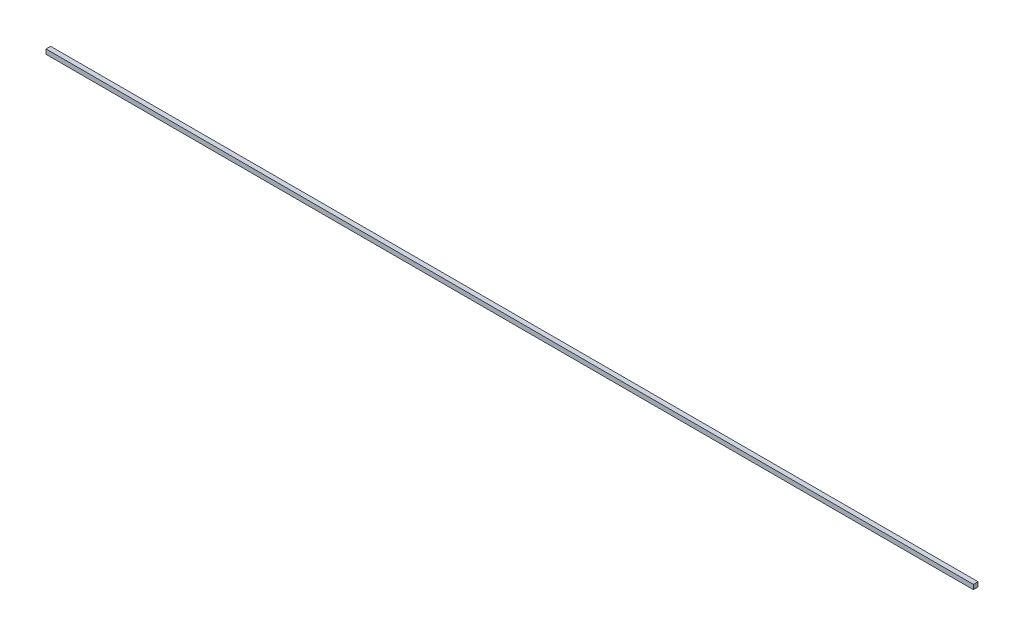
ISO-10303-21;
HEADER;
FILE_DESCRIPTION(('STEP AP214'),'2;1');
FILE_NAME('part.step','',(''),(''),'','','');
FILE_SCHEMA(('AUTOMOTIVE_DESIGN { 1 0 10303 214 1 1 1 1 }'));
ENDSEC;
DATA;
#1=APPLICATION_CONTEXT('core data for automotive mechanical design processes');
#2=APPLICATION_PROTOCOL_DEFINITION('international standard','automotive_design',2000,#1);
#3=PRODUCT_CONTEXT('',#1,'mechanical');
#4=PRODUCT('Part','Part','',(#3));
#5=PRODUCT_RELATED_PRODUCT_CATEGORY('part','',(#4));
#6=PRODUCT_DEFINITION_FORMATION('','',#4);
#7=PRODUCT_DEFINITION_CONTEXT('part definition',#1,'design');
#8=PRODUCT_DEFINITION('design','',#6,#7);
#9=PRODUCT_DEFINITION_SHAPE('','',#8);
#10=(LENGTH_UNIT() NAMED_UNIT(*) SI_UNIT(.MILLI.,.METRE.));
#11=(NAMED_UNIT(*) PLANE_ANGLE_UNIT() SI_UNIT($,.RADIAN.));
#12=(NAMED_UNIT(*) SI_UNIT($,.STERADIAN.) SOLID_ANGLE_UNIT());
#13=UNCERTAINTY_MEASURE_WITH_UNIT(LENGTH_MEASURE(1.E-05),#10,'distance_accuracy_value','');
#14=(GEOMETRIC_REPRESENTATION_CONTEXT(3) GLOBAL_UNCERTAINTY_ASSIGNED_CONTEXT((#13)) GLOBAL_UNIT_ASSIGNED_CONTEXT((#10,
#11,#12)) REPRESENTATION_CONTEXT('',''));
#15=CARTESIAN_POINT('',(0.,0.,0.));
#16=DIRECTION('',(0.,0.,1.));
#17=DIRECTION('',(1.,0.,0.));
#18=AXIS2_PLACEMENT_3D('',#15,#16,#17);
#19=CARTESIAN_POINT('',(0.,0.,3.));
#20=DIRECTION('',(0.,0.,1.));
#21=DIRECTION('',(1.,0.,0.));
#22=AXIS2_PLACEMENT_3D('',#19,#20,#21);
#23=PLANE('',#22);
#24=DIRECTION('',(0.,1.,0.));
#25=VECTOR('',#24,1.);
#26=CARTESIAN_POINT('',(-300.,0.,3.));
#27=LINE('',#26,#25);
#28=CARTESIAN_POINT('',(-300.,-50.,3.));
#29=VERTEX_POINT('',#28);
#30=CARTESIAN_POINT('',(-300.,-47.,3.));
#31=VERTEX_POINT('',#30);
#32=EDGE_CURVE('E84',#29,#31,#27,.T.);
#33=ORIENTED_EDGE('',*,*,#32,.F.);
#34=DIRECTION('',(1.,0.,0.));
#35=VECTOR('',#34,1.);
#36=CARTESIAN_POINT('',(-300.,-50.,3.));
#37=LINE('',#36,#35);
#38=CARTESIAN_POINT('',(300.,-50.,3.));
#39=VERTEX_POINT('',#38);
#40=EDGE_CURVE('E90',#29,#39,#37,.T.);
#41=ORIENTED_EDGE('',*,*,#40,.T.);
#42=DIRECTION('',(0.,1.,0.));
#43=VECTOR('',#42,1.);
#44=CARTESIAN_POINT('',(300.,1.71683972880179E-13,3.));
#45=LINE('',#44,#43);
#46=CARTESIAN_POINT('',(300.,-47.,3.));
#47=VERTEX_POINT('',#46);
#48=EDGE_CURVE('E75',#39,#47,#45,.T.);
#49=ORIENTED_EDGE('',*,*,#48,.T.);
#50=DIRECTION('',(-1.,0.,0.));
#51=VECTOR('',#50,1.);
#52=CARTESIAN_POINT('',(-300.,-47.,3.));
#53=LINE('',#52,#51);
#54=EDGE_CURVE('E89',#47,#31,#53,.T.);
#55=ORIENTED_EDGE('',*,*,#54,.T.);
#56=EDGE_LOOP('',(#33,#41,#49,#55));
#57=FACE_BOUND('',#56,.T.);
#58=ADVANCED_FACE('F32',(#57),#23,.T.);
#59=CARTESIAN_POINT('',(300.,1.71683972880179E-13,0.));
#60=DIRECTION('',(-1.,0.,0.));
#61=DIRECTION('',(0.,-1.,0.));
#62=AXIS2_PLACEMENT_3D('',#59,#60,#61);
#63=PLANE('',#62);
#64=ORIENTED_EDGE('',*,*,#48,.F.);
#65=DIRECTION('',(0.,0.,-1.));
#66=VECTOR('',#65,1.);
#67=CARTESIAN_POINT('',(300.,-50.,60.));
#68=LINE('',#67,#66);
#69=CARTESIAN_POINT('',(300.,-50.,0.));
#70=VERTEX_POINT('',#69);
#71=EDGE_CURVE('E83',#39,#70,#68,.T.);
#72=ORIENTED_EDGE('',*,*,#71,.T.);
#73=DIRECTION('',(0.,-1.,0.));
#74=VECTOR('',#73,1.);
#75=CARTESIAN_POINT('',(300.,3.43367945760358E-13,0.));
#76=LINE('',#75,#74);
#77=CARTESIAN_POINT('',(300.,-47.,0.));
#78=VERTEX_POINT('',#77);
#79=EDGE_CURVE('E78',#78,#70,#76,.T.);
#80=ORIENTED_EDGE('',*,*,#79,.F.);
#81=DIRECTION('',(0.,0.,1.));
#82=VECTOR('',#81,1.);
#83=CARTESIAN_POINT('',(300.,-47.,3.));
#84=LINE('',#83,#82);
#85=EDGE_CURVE('E72',#78,#47,#84,.T.);
#86=ORIENTED_EDGE('',*,*,#85,.T.);
#87=EDGE_LOOP('',(#64,#72,#80,#86));
#88=FACE_BOUND('',#87,.T.);
#89=ADVANCED_FACE('F74',(#88),#63,.F.);
#90=CARTESIAN_POINT('',(-300.,0.,0.));
#91=DIRECTION('',(-1.,0.,0.));
#92=DIRECTION('',(0.,0.,1.));
#93=AXIS2_PLACEMENT_3D('',#90,#91,#92);
#94=PLANE('',#93);
#95=DIRECTION('',(0.,0.,-1.));
#96=VECTOR('',#95,1.);
#97=CARTESIAN_POINT('',(-300.,-50.,60.));
#98=LINE('',#97,#96);
#99=CARTESIAN_POINT('',(-300.,-50.,0.));
#100=VERTEX_POINT('',#99);
#101=EDGE_CURVE('E47',#29,#100,#98,.T.);
#102=ORIENTED_EDGE('',*,*,#101,.F.);
#103=ORIENTED_EDGE('',*,*,#32,.T.);
#104=DIRECTION('',(0.,0.,1.));
#105=VECTOR('',#104,1.);
#106=CARTESIAN_POINT('',(-300.,-47.,3.));
#107=LINE('',#106,#105);
#108=CARTESIAN_POINT('',(-300.,-47.,0.));
#109=VERTEX_POINT('',#108);
#110=EDGE_CURVE('E11',#109,#31,#107,.T.);
#111=ORIENTED_EDGE('',*,*,#110,.F.);
#112=DIRECTION('',(0.,-1.,0.));
#113=VECTOR('',#112,1.);
#114=CARTESIAN_POINT('',(-300.,0.,0.));
#115=LINE('',#114,#113);
#116=EDGE_CURVE('E96',#109,#100,#115,.T.);
#117=ORIENTED_EDGE('',*,*,#116,.T.);
#118=EDGE_LOOP('',(#102,#103,#111,#117));
#119=FACE_BOUND('',#118,.T.);
#120=ADVANCED_FACE('F103',(#119),#94,.T.);
#121=CARTESIAN_POINT('',(-300.,-50.,60.));
#122=DIRECTION('',(0.,1.,0.));
#123=DIRECTION('',(0.,0.,1.));
#124=AXIS2_PLACEMENT_3D('',#121,#122,#123);
#125=PLANE('',#124);
#126=ORIENTED_EDGE('',*,*,#40,.F.);
#127=ORIENTED_EDGE('',*,*,#101,.T.);
#128=DIRECTION('',(1.,0.,0.));
#129=VECTOR('',#128,1.);
#130=CARTESIAN_POINT('',(-300.,-50.,0.));
#131=LINE('',#130,#129);
#132=EDGE_CURVE('E40',#100,#70,#131,.T.);
#133=ORIENTED_EDGE('',*,*,#132,.T.);
#134=ORIENTED_EDGE('',*,*,#71,.F.);
#135=EDGE_LOOP('',(#126,#127,#133,#134));
#136=FACE_BOUND('',#135,.T.);
#137=ADVANCED_FACE('F34',(#136),#125,.F.);
#138=CARTESIAN_POINT('',(-300.,-47.,3.));
#139=DIRECTION('',(0.,-1.,0.));
#140=DIRECTION('',(0.,0.,-1.));
#141=AXIS2_PLACEMENT_3D('',#138,#139,#140);
#142=PLANE('',#141);
#143=ORIENTED_EDGE('',*,*,#54,.F.);
#144=ORIENTED_EDGE('',*,*,#85,.F.);
#145=DIRECTION('',(-1.,0.,0.));
#146=VECTOR('',#145,1.);
#147=CARTESIAN_POINT('',(300.,-47.,0.));
#148=LINE('',#147,#146);
#149=EDGE_CURVE('E97',#78,#109,#148,.T.);
#150=ORIENTED_EDGE('',*,*,#149,.T.);
#151=ORIENTED_EDGE('',*,*,#110,.T.);
#152=EDGE_LOOP('',(#143,#144,#150,#151));
#153=FACE_BOUND('',#152,.T.);
#154=ADVANCED_FACE('F92',(#153),#142,.F.);
#155=CARTESIAN_POINT('',(-300.,0.,0.));
#156=DIRECTION('',(0.,0.,1.));
#157=DIRECTION('',(1.,0.,0.));
#158=AXIS2_PLACEMENT_3D('',#155,#156,#157);
#159=PLANE('',#158);
#160=ORIENTED_EDGE('',*,*,#116,.F.);
#161=ORIENTED_EDGE('',*,*,#149,.F.);
#162=ORIENTED_EDGE('',*,*,#79,.T.);
#163=ORIENTED_EDGE('',*,*,#132,.F.);
#164=EDGE_LOOP('',(#160,#161,#162,#163));
#165=FACE_BOUND('',#164,.T.);
#166=ADVANCED_FACE('F106',(#165),#159,.F.);
#167=CLOSED_SHELL('',(#58,#89,#120,#137,#154,#166));
#168=MANIFOLD_SOLID_BREP('B2',#167);
#169=ADVANCED_BREP_SHAPE_REPRESENTATION('',(#18,#168),#14);
#170=SHAPE_DEFINITION_REPRESENTATION(#9,#169);
ENDSEC;
END-ISO-10303-21;
